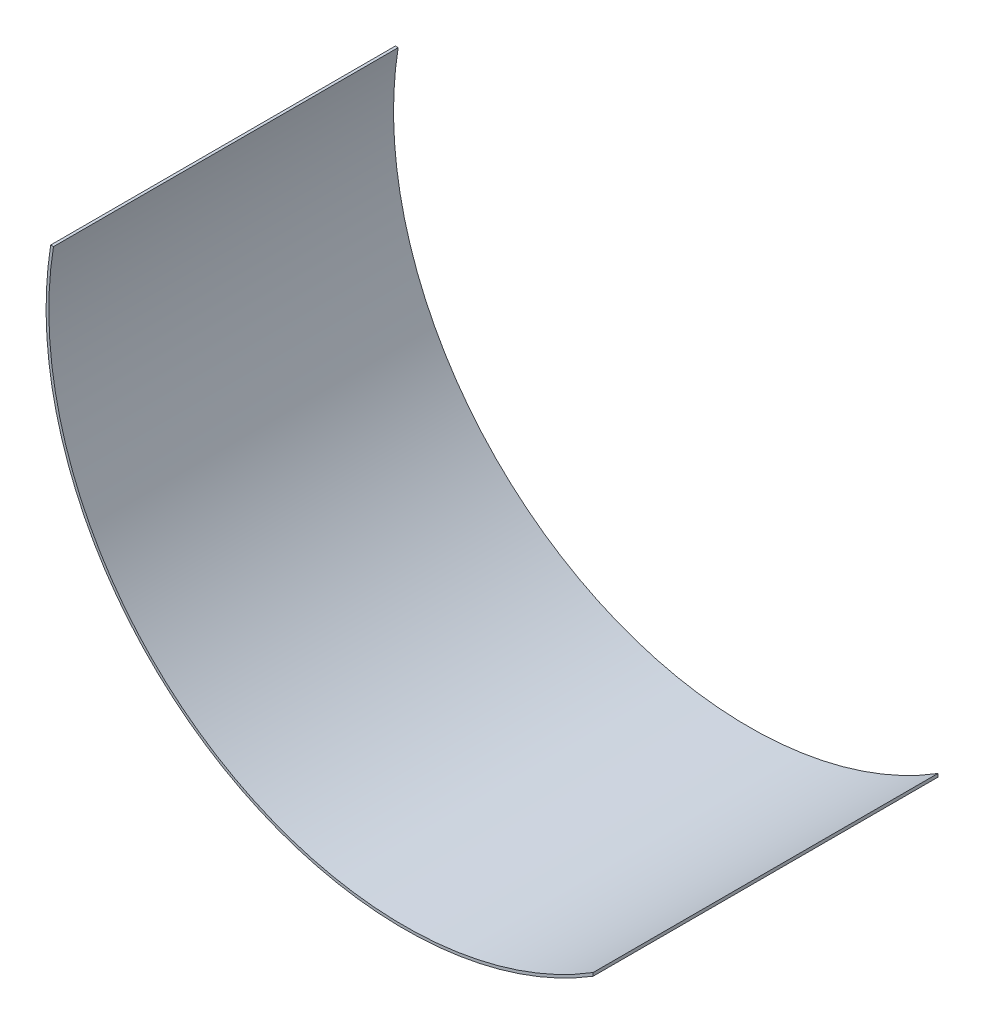
ISO-10303-21;
HEADER;
FILE_DESCRIPTION(('STEP AP214'),'2;1');
FILE_NAME('part.step','',(''),(''),'','','');
FILE_SCHEMA(('AUTOMOTIVE_DESIGN { 1 0 10303 214 1 1 1 1 }'));
ENDSEC;
DATA;
#1=APPLICATION_CONTEXT('core data for automotive mechanical design processes');
#2=APPLICATION_PROTOCOL_DEFINITION('international standard','automotive_design',2000,#1);
#3=PRODUCT_CONTEXT('',#1,'mechanical');
#4=PRODUCT('Part','Part','',(#3));
#5=PRODUCT_RELATED_PRODUCT_CATEGORY('part','',(#4));
#6=PRODUCT_DEFINITION_FORMATION('','',#4);
#7=PRODUCT_DEFINITION_CONTEXT('part definition',#1,'design');
#8=PRODUCT_DEFINITION('design','',#6,#7);
#9=PRODUCT_DEFINITION_SHAPE('','',#8);
#10=(LENGTH_UNIT() NAMED_UNIT(*) SI_UNIT(.MILLI.,.METRE.));
#11=(NAMED_UNIT(*) PLANE_ANGLE_UNIT() SI_UNIT($,.RADIAN.));
#12=(NAMED_UNIT(*) SI_UNIT($,.STERADIAN.) SOLID_ANGLE_UNIT());
#13=UNCERTAINTY_MEASURE_WITH_UNIT(LENGTH_MEASURE(1.E-05),#10,'distance_accuracy_value','');
#14=(GEOMETRIC_REPRESENTATION_CONTEXT(3) GLOBAL_UNCERTAINTY_ASSIGNED_CONTEXT((#13)) GLOBAL_UNIT_ASSIGNED_CONTEXT((#10,
#11,#12)) REPRESENTATION_CONTEXT('',''));
#15=CARTESIAN_POINT('',(0.,0.,0.));
#16=DIRECTION('',(0.,0.,1.));
#17=DIRECTION('',(1.,0.,0.));
#18=AXIS2_PLACEMENT_3D('',#15,#16,#17);
#19=CARTESIAN_POINT('',(-31.5326870594106,19.9144592798461,158.75));
#20=DIRECTION('',(0.,0.,-1.));
#21=DIRECTION('',(-1.,0.,0.));
#22=AXIS2_PLACEMENT_3D('',#19,#20,#21);
#23=CYLINDRICAL_SURFACE('',#22,165.062282848658);
#24=CARTESIAN_POINT('',(-31.5326870594106,19.9144592798461,158.75));
#25=DIRECTION('',(0.,0.,1.));
#26=DIRECTION('',(1.,0.,0.));
#27=AXIS2_PLACEMENT_3D('',#24,#25,#26);
#28=CIRCLE('',#27,165.062282848658);
#29=CARTESIAN_POINT('',(-194.470026723061,46.314848719069,158.75));
#30=VERTEX_POINT('',#29);
#31=CARTESIAN_POINT('',(55.3995623549834,-120.400690404584,158.75));
#32=VERTEX_POINT('',#31);
#33=EDGE_CURVE('E84',#30,#32,#28,.T.);
#34=ORIENTED_EDGE('',*,*,#33,.F.);
#35=DIRECTION('',(0.,0.,-1.));
#36=VECTOR('',#35,1.);
#37=CARTESIAN_POINT('',(-194.470026723061,46.314848719069,158.75));
#38=LINE('',#37,#36);
#39=CARTESIAN_POINT('',(-194.470026723061,46.314848719069,0.));
#40=VERTEX_POINT('',#39);
#41=EDGE_CURVE('E72',#30,#40,#38,.T.);
#42=ORIENTED_EDGE('',*,*,#41,.T.);
#43=CARTESIAN_POINT('',(-31.5326870594106,19.9144592798461,0.));
#44=DIRECTION('',(0.,0.,1.));
#45=DIRECTION('',(1.,0.,0.));
#46=AXIS2_PLACEMENT_3D('',#43,#44,#45);
#47=CIRCLE('',#46,165.062282848658);
#48=CARTESIAN_POINT('',(55.3995623549834,-120.400690404584,0.));
#49=VERTEX_POINT('',#48);
#50=EDGE_CURVE('E91',#40,#49,#47,.T.);
#51=ORIENTED_EDGE('',*,*,#50,.T.);
#52=DIRECTION('',(0.,0.,-1.));
#53=VECTOR('',#52,1.);
#54=CARTESIAN_POINT('',(55.3995623549834,-120.400690404584,158.75));
#55=LINE('',#54,#53);
#56=EDGE_CURVE('E90',#32,#49,#55,.T.);
#57=ORIENTED_EDGE('',*,*,#56,.F.);
#58=EDGE_LOOP('',(#34,#42,#51,#57));
#59=FACE_BOUND('',#58,.T.);
#60=ADVANCED_FACE('F33',(#59),#23,.T.);
#61=CARTESIAN_POINT('',(-31.5326870594106,19.9144592798461,158.75));
#62=DIRECTION('',(0.,0.,1.));
#63=DIRECTION('',(1.,0.,0.));
#64=AXIS2_PLACEMENT_3D('',#61,#62,#63);
#65=PLANE('',#64);
#66=DIRECTION('',(1.,0.,0.));
#67=VECTOR('',#66,1.);
#68=CARTESIAN_POINT('',(-216.309132875079,46.314848719069,158.75));
#69=LINE('',#68,#67);
#70=CARTESIAN_POINT('',(-193.183333078015,46.314848719069,158.75));
#71=VERTEX_POINT('',#70);
#72=EDGE_CURVE('E46',#30,#71,#69,.T.);
#73=ORIENTED_EDGE('',*,*,#72,.F.);
#74=ORIENTED_EDGE('',*,*,#33,.T.);
#75=DIRECTION('',(0.,1.,0.));
#76=VECTOR('',#75,1.);
#77=CARTESIAN_POINT('',(55.3995623549834,-154.390125246719,158.75));
#78=LINE('',#77,#76);
#79=CARTESIAN_POINT('',(55.3995623549834,-118.904472903515,158.75));
#80=VERTEX_POINT('',#79);
#81=EDGE_CURVE('E78',#32,#80,#78,.T.);
#82=ORIENTED_EDGE('',*,*,#81,.T.);
#83=CARTESIAN_POINT('',(-31.5326870594106,19.9144592798461,158.75));
#84=DIRECTION('',(0.,0.,1.));
#85=DIRECTION('',(1.,0.,0.));
#86=AXIS2_PLACEMENT_3D('',#83,#84,#85);
#87=CIRCLE('',#86,163.792282848658);
#88=EDGE_CURVE('E86',#71,#80,#87,.T.);
#89=ORIENTED_EDGE('',*,*,#88,.F.);
#90=EDGE_LOOP('',(#73,#74,#82,#89));
#91=FACE_BOUND('',#90,.T.);
#92=ADVANCED_FACE('F82',(#91),#65,.T.);
#93=CARTESIAN_POINT('',(-31.5326870594106,19.9144592798461,0.));
#94=DIRECTION('',(0.,0.,1.));
#95=DIRECTION('',(1.,0.,0.));
#96=AXIS2_PLACEMENT_3D('',#93,#94,#95);
#97=PLANE('',#96);
#98=ORIENTED_EDGE('',*,*,#50,.F.);
#99=DIRECTION('',(1.,0.,0.));
#100=VECTOR('',#99,1.);
#101=CARTESIAN_POINT('',(-216.309132875079,46.314848719069,0.));
#102=LINE('',#101,#100);
#103=CARTESIAN_POINT('',(-193.183333078015,46.314848719069,0.));
#104=VERTEX_POINT('',#103);
#105=EDGE_CURVE('E74',#40,#104,#102,.T.);
#106=ORIENTED_EDGE('',*,*,#105,.T.);
#107=CARTESIAN_POINT('',(-31.5326870594106,19.9144592798461,0.));
#108=DIRECTION('',(0.,0.,1.));
#109=DIRECTION('',(1.,0.,0.));
#110=AXIS2_PLACEMENT_3D('',#107,#108,#109);
#111=CIRCLE('',#110,163.792282848658);
#112=CARTESIAN_POINT('',(55.3995623549834,-118.904472903515,0.));
#113=VERTEX_POINT('',#112);
#114=EDGE_CURVE('E54',#104,#113,#111,.T.);
#115=ORIENTED_EDGE('',*,*,#114,.T.);
#116=DIRECTION('',(0.,1.,0.));
#117=VECTOR('',#116,1.);
#118=CARTESIAN_POINT('',(55.3995623549834,-154.390125246719,0.));
#119=LINE('',#118,#117);
#120=EDGE_CURVE('E99',#49,#113,#119,.T.);
#121=ORIENTED_EDGE('',*,*,#120,.F.);
#122=EDGE_LOOP('',(#98,#106,#115,#121));
#123=FACE_BOUND('',#122,.T.);
#124=ADVANCED_FACE('F102',(#123),#97,.F.);
#125=CARTESIAN_POINT('',(-31.5326870594106,19.9144592798461,158.75));
#126=DIRECTION('',(0.,0.,-1.));
#127=DIRECTION('',(-1.,0.,0.));
#128=AXIS2_PLACEMENT_3D('',#125,#126,#127);
#129=CYLINDRICAL_SURFACE('',#128,163.792282848658);
#130=DIRECTION('',(0.,0.,-1.));
#131=VECTOR('',#130,1.);
#132=CARTESIAN_POINT('',(-193.183333078015,46.314848719069,158.75));
#133=LINE('',#132,#131);
#134=EDGE_CURVE('E11',#71,#104,#133,.T.);
#135=ORIENTED_EDGE('',*,*,#134,.F.);
#136=ORIENTED_EDGE('',*,*,#88,.T.);
#137=DIRECTION('',(0.,0.,-1.));
#138=VECTOR('',#137,1.);
#139=CARTESIAN_POINT('',(55.3995623549834,-118.904472903515,158.75));
#140=LINE('',#139,#138);
#141=EDGE_CURVE('E40',#80,#113,#140,.T.);
#142=ORIENTED_EDGE('',*,*,#141,.T.);
#143=ORIENTED_EDGE('',*,*,#114,.F.);
#144=EDGE_LOOP('',(#135,#136,#142,#143));
#145=FACE_BOUND('',#144,.T.);
#146=ADVANCED_FACE('F104',(#145),#129,.F.);
#147=CARTESIAN_POINT('',(55.3995623549834,-154.390125246719,0.));
#148=DIRECTION('',(1.,0.,0.));
#149=DIRECTION('',(0.,0.,-1.));
#150=AXIS2_PLACEMENT_3D('',#147,#148,#149);
#151=PLANE('',#150);
#152=ORIENTED_EDGE('',*,*,#56,.T.);
#153=ORIENTED_EDGE('',*,*,#120,.T.);
#154=ORIENTED_EDGE('',*,*,#141,.F.);
#155=ORIENTED_EDGE('',*,*,#81,.F.);
#156=EDGE_LOOP('',(#152,#153,#154,#155));
#157=FACE_BOUND('',#156,.T.);
#158=ADVANCED_FACE('F107',(#157),#151,.T.);
#159=CARTESIAN_POINT('',(-216.309132875079,46.314848719069,0.));
#160=DIRECTION('',(0.,-1.,0.));
#161=DIRECTION('',(0.,0.,-1.));
#162=AXIS2_PLACEMENT_3D('',#159,#160,#161);
#163=PLANE('',#162);
#164=ORIENTED_EDGE('',*,*,#72,.T.);
#165=ORIENTED_EDGE('',*,*,#134,.T.);
#166=ORIENTED_EDGE('',*,*,#105,.F.);
#167=ORIENTED_EDGE('',*,*,#41,.F.);
#168=EDGE_LOOP('',(#164,#165,#166,#167));
#169=FACE_BOUND('',#168,.T.);
#170=ADVANCED_FACE('F73',(#169),#163,.F.);
#171=CLOSED_SHELL('',(#60,#92,#124,#146,#158,#170));
#172=MANIFOLD_SOLID_BREP('B2',#171);
#173=ADVANCED_BREP_SHAPE_REPRESENTATION('',(#18,#172),#14);
#174=SHAPE_DEFINITION_REPRESENTATION(#9,#173);
ENDSEC;
END-ISO-10303-21;
